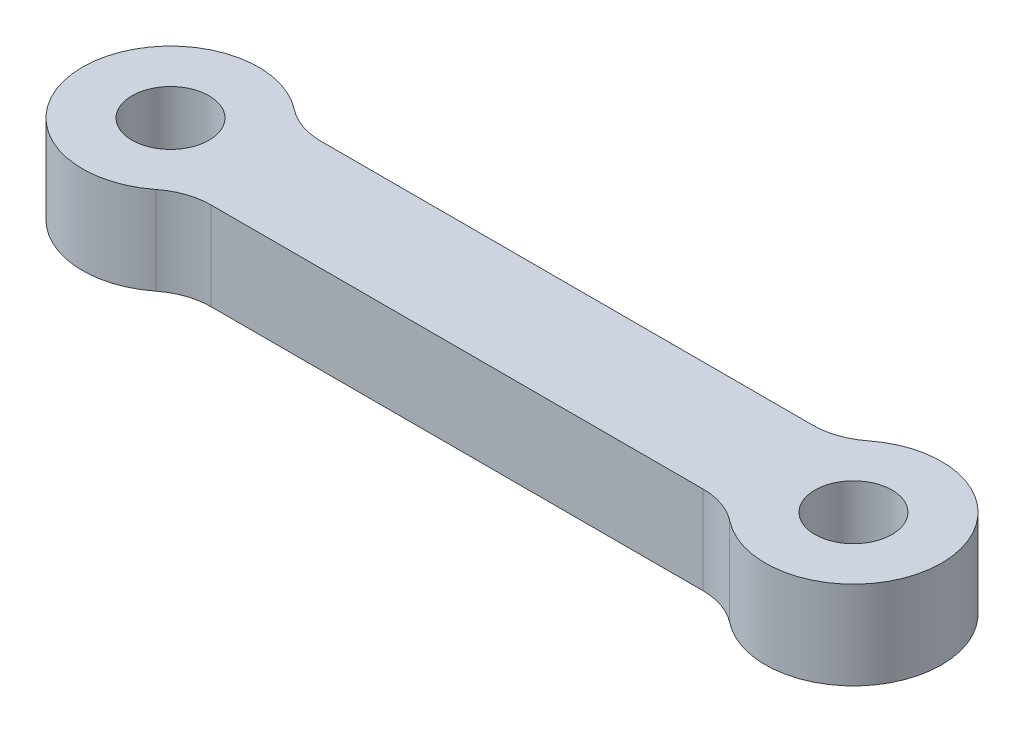
ISO-10303-21;
HEADER;
FILE_DESCRIPTION(('STEP AP214'),'2;1');
FILE_NAME('part.step','',(''),(''),'','','');
FILE_SCHEMA(('AUTOMOTIVE_DESIGN { 1 0 10303 214 1 1 1 1 }'));
ENDSEC;
DATA;
#1=APPLICATION_CONTEXT('core data for automotive mechanical design processes');
#2=APPLICATION_PROTOCOL_DEFINITION('international standard','automotive_design',2000,#1);
#3=PRODUCT_CONTEXT('',#1,'mechanical');
#4=PRODUCT('Part','Part','',(#3));
#5=PRODUCT_RELATED_PRODUCT_CATEGORY('part','',(#4));
#6=PRODUCT_DEFINITION_FORMATION('','',#4);
#7=PRODUCT_DEFINITION_CONTEXT('part definition',#1,'design');
#8=PRODUCT_DEFINITION('design','',#6,#7);
#9=PRODUCT_DEFINITION_SHAPE('','',#8);
#10=(LENGTH_UNIT() NAMED_UNIT(*) SI_UNIT(.MILLI.,.METRE.));
#11=(NAMED_UNIT(*) PLANE_ANGLE_UNIT() SI_UNIT($,.RADIAN.));
#12=(NAMED_UNIT(*) SI_UNIT($,.STERADIAN.) SOLID_ANGLE_UNIT());
#13=UNCERTAINTY_MEASURE_WITH_UNIT(LENGTH_MEASURE(1.E-05),#10,'distance_accuracy_value','');
#14=(GEOMETRIC_REPRESENTATION_CONTEXT(3) GLOBAL_UNCERTAINTY_ASSIGNED_CONTEXT((#13)) GLOBAL_UNIT_ASSIGNED_CONTEXT((#10,
#11,#12)) REPRESENTATION_CONTEXT('',''));
#15=CARTESIAN_POINT('',(0.,0.,0.));
#16=DIRECTION('',(0.,0.,1.));
#17=DIRECTION('',(1.,0.,0.));
#18=AXIS2_PLACEMENT_3D('',#15,#16,#17);
#19=CARTESIAN_POINT('',(31.,4.,0.));
#20=DIRECTION('',(0.,-1.,0.));
#21=DIRECTION('',(0.,0.,-1.));
#22=AXIS2_PLACEMENT_3D('',#19,#20,#21);
#23=CYLINDRICAL_SURFACE('',#22,4.00000000000001);
#24=CARTESIAN_POINT('',(31.,4.,0.));
#25=DIRECTION('',(0.,1.,0.));
#26=DIRECTION('',(0.,0.,1.));
#27=AXIS2_PLACEMENT_3D('',#24,#25,#26);
#28=CIRCLE('',#27,4.00000000000001);
#29=CARTESIAN_POINT('',(28.525641703473,4.,3.14285714285714));
#30=VERTEX_POINT('',#29);
#31=CARTESIAN_POINT('',(28.525641703473,4.,-3.14285714285714));
#32=VERTEX_POINT('',#31);
#33=EDGE_CURVE('E142',#30,#32,#28,.T.);
#34=ORIENTED_EDGE('',*,*,#33,.F.);
#35=DIRECTION('',(0.,-1.,0.));
#36=VECTOR('',#35,1.);
#37=CARTESIAN_POINT('',(28.525641703473,4.,3.14285714285714));
#38=LINE('',#37,#36);
#39=CARTESIAN_POINT('',(28.525641703473,0.,3.14285714285714));
#40=VERTEX_POINT('',#39);
#41=EDGE_CURVE('E150',#30,#40,#38,.T.);
#42=ORIENTED_EDGE('',*,*,#41,.T.);
#43=CARTESIAN_POINT('',(31.,0.,0.));
#44=DIRECTION('',(0.,1.,0.));
#45=DIRECTION('',(0.,0.,1.));
#46=AXIS2_PLACEMENT_3D('',#43,#44,#45);
#47=CIRCLE('',#46,4.00000000000001);
#48=CARTESIAN_POINT('',(28.525641703473,0.,-3.14285714285714));
#49=VERTEX_POINT('',#48);
#50=EDGE_CURVE('E167',#40,#49,#47,.T.);
#51=ORIENTED_EDGE('',*,*,#50,.T.);
#52=DIRECTION('',(0.,-1.,0.));
#53=VECTOR('',#52,1.);
#54=CARTESIAN_POINT('',(28.525641703473,4.,-3.14285714285714));
#55=LINE('',#54,#53);
#56=EDGE_CURVE('E148',#49,#32,#55,.F.);
#57=ORIENTED_EDGE('',*,*,#56,.T.);
#58=EDGE_LOOP('',(#34,#42,#51,#57));
#59=FACE_BOUND('',#58,.T.);
#60=ADVANCED_FACE('F36',(#59),#23,.T.);
#61=CARTESIAN_POINT('',(0.,4.,-2.5));
#62=DIRECTION('',(0.,0.,-1.));
#63=DIRECTION('',(-1.,0.,0.));
#64=AXIS2_PLACEMENT_3D('',#61,#62,#63);
#65=PLANE('',#64);
#66=DIRECTION('',(1.,0.,0.));
#67=VECTOR('',#66,1.);
#68=CARTESIAN_POINT('',(0.,4.,-2.5));
#69=LINE('',#68,#67);
#70=CARTESIAN_POINT('',(4.33012701892219,4.,-2.5));
#71=VERTEX_POINT('',#70);
#72=CARTESIAN_POINT('',(26.6698729810778,4.,-2.5));
#73=VERTEX_POINT('',#72);
#74=EDGE_CURVE('E174',#71,#73,#69,.T.);
#75=ORIENTED_EDGE('',*,*,#74,.T.);
#76=DIRECTION('',(0.,-1.,0.));
#77=VECTOR('',#76,1.);
#78=CARTESIAN_POINT('',(26.6698729810778,4.,-2.5));
#79=LINE('',#78,#77);
#80=CARTESIAN_POINT('',(26.6698729810778,0.,-2.5));
#81=VERTEX_POINT('',#80);
#82=EDGE_CURVE('E113',#73,#81,#79,.T.);
#83=ORIENTED_EDGE('',*,*,#82,.T.);
#84=DIRECTION('',(1.,0.,0.));
#85=VECTOR('',#84,1.);
#86=CARTESIAN_POINT('',(0.,0.,-2.5));
#87=LINE('',#86,#85);
#88=CARTESIAN_POINT('',(4.33012701892219,0.,-2.5));
#89=VERTEX_POINT('',#88);
#90=EDGE_CURVE('E136',#89,#81,#87,.T.);
#91=ORIENTED_EDGE('',*,*,#90,.F.);
#92=DIRECTION('',(0.,-1.,0.));
#93=VECTOR('',#92,1.);
#94=CARTESIAN_POINT('',(4.33012701892219,4.,-2.5));
#95=LINE('',#94,#93);
#96=EDGE_CURVE('E58',#89,#71,#95,.F.);
#97=ORIENTED_EDGE('',*,*,#96,.T.);
#98=EDGE_LOOP('',(#75,#83,#91,#97));
#99=FACE_BOUND('',#98,.T.);
#100=ADVANCED_FACE('F165',(#99),#65,.T.);
#101=CARTESIAN_POINT('',(0.,4.,0.));
#102=DIRECTION('',(0.,-1.,0.));
#103=DIRECTION('',(0.,0.,-1.));
#104=AXIS2_PLACEMENT_3D('',#101,#102,#103);
#105=CYLINDRICAL_SURFACE('',#104,4.);
#106=CARTESIAN_POINT('',(0.,0.,0.));
#107=DIRECTION('',(0.,1.,0.));
#108=DIRECTION('',(0.,0.,1.));
#109=AXIS2_PLACEMENT_3D('',#106,#107,#108);
#110=CIRCLE('',#109,4.);
#111=CARTESIAN_POINT('',(2.47435829652697,0.,-3.14285714285714));
#112=VERTEX_POINT('',#111);
#113=CARTESIAN_POINT('',(2.47435829652697,0.,3.14285714285714));
#114=VERTEX_POINT('',#113);
#115=EDGE_CURVE('E131',#112,#114,#110,.T.);
#116=ORIENTED_EDGE('',*,*,#115,.T.);
#117=DIRECTION('',(0.,-1.,0.));
#118=VECTOR('',#117,1.);
#119=CARTESIAN_POINT('',(2.47435829652697,4.,3.14285714285714));
#120=LINE('',#119,#118);
#121=CARTESIAN_POINT('',(2.47435829652697,4.,3.14285714285714));
#122=VERTEX_POINT('',#121);
#123=EDGE_CURVE('E107',#114,#122,#120,.F.);
#124=ORIENTED_EDGE('',*,*,#123,.T.);
#125=CARTESIAN_POINT('',(0.,4.,0.));
#126=DIRECTION('',(0.,1.,0.));
#127=DIRECTION('',(0.,0.,1.));
#128=AXIS2_PLACEMENT_3D('',#125,#126,#127);
#129=CIRCLE('',#128,4.);
#130=CARTESIAN_POINT('',(2.47435829652697,4.,-3.14285714285714));
#131=VERTEX_POINT('',#130);
#132=EDGE_CURVE('E173',#131,#122,#129,.T.);
#133=ORIENTED_EDGE('',*,*,#132,.F.);
#134=DIRECTION('',(0.,-1.,0.));
#135=VECTOR('',#134,1.);
#136=CARTESIAN_POINT('',(2.47435829652697,4.,-3.14285714285714));
#137=LINE('',#136,#135);
#138=EDGE_CURVE('E123',#131,#112,#137,.T.);
#139=ORIENTED_EDGE('',*,*,#138,.T.);
#140=EDGE_LOOP('',(#116,#124,#133,#139));
#141=FACE_BOUND('',#140,.T.);
#142=ADVANCED_FACE('F176',(#141),#105,.T.);
#143=CARTESIAN_POINT('',(0.,4.,0.));
#144=DIRECTION('',(0.,-1.,0.));
#145=DIRECTION('',(0.,0.,-1.));
#146=AXIS2_PLACEMENT_3D('',#143,#144,#145);
#147=CYLINDRICAL_SURFACE('',#146,1.75);
#148=CARTESIAN_POINT('',(0.,4.,0.));
#149=DIRECTION('',(0.,1.,0.));
#150=DIRECTION('',(0.,0.,1.));
#151=AXIS2_PLACEMENT_3D('',#148,#149,#150);
#152=CIRCLE('',#151,1.75);
#153=CARTESIAN_POINT('',(0.,4.,1.75));
#154=VERTEX_POINT('',#153);
#155=EDGE_CURVE('E178',#154,#154,#152,.T.);
#156=ORIENTED_EDGE('',*,*,#155,.T.);
#157=EDGE_LOOP('',(#156));
#158=FACE_BOUND('',#157,.T.);
#159=CARTESIAN_POINT('',(0.,0.,0.));
#160=DIRECTION('',(0.,1.,0.));
#161=DIRECTION('',(0.,0.,1.));
#162=AXIS2_PLACEMENT_3D('',#159,#160,#161);
#163=CIRCLE('',#162,1.75);
#164=CARTESIAN_POINT('',(0.,0.,1.75));
#165=VERTEX_POINT('',#164);
#166=EDGE_CURVE('E130',#165,#165,#163,.T.);
#167=ORIENTED_EDGE('',*,*,#166,.F.);
#168=EDGE_LOOP('',(#167));
#169=FACE_BOUND('',#168,.T.);
#170=ADVANCED_FACE('F224',(#158,#169),#147,.F.);
#171=CARTESIAN_POINT('',(0.,4.,2.5));
#172=DIRECTION('',(0.,0.,-1.));
#173=DIRECTION('',(-1.,0.,0.));
#174=AXIS2_PLACEMENT_3D('',#171,#172,#173);
#175=PLANE('',#174);
#176=DIRECTION('',(1.,0.,0.));
#177=VECTOR('',#176,1.);
#178=CARTESIAN_POINT('',(0.,4.,2.5));
#179=LINE('',#178,#177);
#180=CARTESIAN_POINT('',(4.3301270189222,4.,2.5));
#181=VERTEX_POINT('',#180);
#182=CARTESIAN_POINT('',(26.6698729810778,4.,2.5));
#183=VERTEX_POINT('',#182);
#184=EDGE_CURVE('E122',#181,#183,#179,.T.);
#185=ORIENTED_EDGE('',*,*,#184,.F.);
#186=DIRECTION('',(0.,1.,0.));
#187=VECTOR('',#186,1.);
#188=CARTESIAN_POINT('',(4.3301270189222,0.,2.5));
#189=LINE('',#188,#187);
#190=CARTESIAN_POINT('',(4.3301270189222,0.,2.5));
#191=VERTEX_POINT('',#190);
#192=EDGE_CURVE('E106',#181,#191,#189,.F.);
#193=ORIENTED_EDGE('',*,*,#192,.T.);
#194=DIRECTION('',(1.,0.,0.));
#195=VECTOR('',#194,1.);
#196=CARTESIAN_POINT('',(0.,0.,2.5));
#197=LINE('',#196,#195);
#198=CARTESIAN_POINT('',(26.6698729810778,0.,2.5));
#199=VERTEX_POINT('',#198);
#200=EDGE_CURVE('E119',#191,#199,#197,.T.);
#201=ORIENTED_EDGE('',*,*,#200,.T.);
#202=DIRECTION('',(0.,1.,0.));
#203=VECTOR('',#202,1.);
#204=CARTESIAN_POINT('',(26.6698729810778,4.,2.5));
#205=LINE('',#204,#203);
#206=EDGE_CURVE('E124',#199,#183,#205,.T.);
#207=ORIENTED_EDGE('',*,*,#206,.T.);
#208=EDGE_LOOP('',(#185,#193,#201,#207));
#209=FACE_BOUND('',#208,.T.);
#210=ADVANCED_FACE('F118',(#209),#175,.F.);
#211=CARTESIAN_POINT('',(31.,4.,0.));
#212=DIRECTION('',(0.,-1.,0.));
#213=DIRECTION('',(0.,0.,-1.));
#214=AXIS2_PLACEMENT_3D('',#211,#212,#213);
#215=CYLINDRICAL_SURFACE('',#214,1.75);
#216=CARTESIAN_POINT('',(31.,4.,0.));
#217=DIRECTION('',(0.,1.,0.));
#218=DIRECTION('',(0.,0.,1.));
#219=AXIS2_PLACEMENT_3D('',#216,#217,#218);
#220=CIRCLE('',#219,1.75);
#221=CARTESIAN_POINT('',(31.,4.,1.75));
#222=VERTEX_POINT('',#221);
#223=EDGE_CURVE('E143',#222,#222,#220,.T.);
#224=ORIENTED_EDGE('',*,*,#223,.T.);
#225=EDGE_LOOP('',(#224));
#226=FACE_BOUND('',#225,.T.);
#227=CARTESIAN_POINT('',(31.,0.,0.));
#228=DIRECTION('',(0.,1.,0.));
#229=DIRECTION('',(0.,0.,1.));
#230=AXIS2_PLACEMENT_3D('',#227,#228,#229);
#231=CIRCLE('',#230,1.75);
#232=CARTESIAN_POINT('',(31.,0.,1.75));
#233=VERTEX_POINT('',#232);
#234=EDGE_CURVE('E134',#233,#233,#231,.T.);
#235=ORIENTED_EDGE('',*,*,#234,.F.);
#236=EDGE_LOOP('',(#235));
#237=FACE_BOUND('',#236,.T.);
#238=ADVANCED_FACE('F218',(#226,#237),#215,.F.);
#239=CARTESIAN_POINT('',(0.,4.,0.));
#240=DIRECTION('',(0.,1.,0.));
#241=DIRECTION('',(0.,0.,1.));
#242=AXIS2_PLACEMENT_3D('',#239,#240,#241);
#243=PLANE('',#242);
#244=ORIENTED_EDGE('',*,*,#184,.T.);
#245=CARTESIAN_POINT('',(26.6698729810778,4.,5.5));
#246=DIRECTION('',(0.,1.,0.));
#247=DIRECTION('',(0.,0.,1.));
#248=AXIS2_PLACEMENT_3D('',#245,#246,#247);
#249=CIRCLE('',#248,3.);
#250=EDGE_CURVE('E158',#183,#30,#249,.F.);
#251=ORIENTED_EDGE('',*,*,#250,.T.);
#252=ORIENTED_EDGE('',*,*,#33,.T.);
#253=CARTESIAN_POINT('',(26.6698729810778,4.,-5.5));
#254=DIRECTION('',(0.,1.,0.));
#255=DIRECTION('',(0.,0.,1.));
#256=AXIS2_PLACEMENT_3D('',#253,#254,#255);
#257=CIRCLE('',#256,3.);
#258=EDGE_CURVE('E51',#32,#73,#257,.F.);
#259=ORIENTED_EDGE('',*,*,#258,.T.);
#260=ORIENTED_EDGE('',*,*,#74,.F.);
#261=CARTESIAN_POINT('',(4.33012701892219,4.,-5.5));
#262=DIRECTION('',(0.,1.,0.));
#263=DIRECTION('',(0.,0.,1.));
#264=AXIS2_PLACEMENT_3D('',#261,#262,#263);
#265=CIRCLE('',#264,3.);
#266=EDGE_CURVE('E11',#71,#131,#265,.F.);
#267=ORIENTED_EDGE('',*,*,#266,.T.);
#268=ORIENTED_EDGE('',*,*,#132,.T.);
#269=CARTESIAN_POINT('',(4.3301270189222,4.,5.5));
#270=DIRECTION('',(0.,1.,0.));
#271=DIRECTION('',(0.,0.,1.));
#272=AXIS2_PLACEMENT_3D('',#269,#270,#271);
#273=CIRCLE('',#272,3.);
#274=EDGE_CURVE('E112',#122,#181,#273,.F.);
#275=ORIENTED_EDGE('',*,*,#274,.T.);
#276=EDGE_LOOP('',(#244,#251,#252,#259,#260,#267,#268,#275));
#277=FACE_BOUND('',#276,.T.);
#278=ORIENTED_EDGE('',*,*,#155,.F.);
#279=EDGE_LOOP('',(#278));
#280=FACE_BOUND('',#279,.T.);
#281=ORIENTED_EDGE('',*,*,#223,.F.);
#282=EDGE_LOOP('',(#281));
#283=FACE_BOUND('',#282,.T.);
#284=ADVANCED_FACE('F171',(#277,#280,#283),#243,.T.);
#285=CARTESIAN_POINT('',(0.,0.,0.));
#286=DIRECTION('',(0.,1.,0.));
#287=DIRECTION('',(0.,0.,1.));
#288=AXIS2_PLACEMENT_3D('',#285,#286,#287);
#289=PLANE('',#288);
#290=ORIENTED_EDGE('',*,*,#50,.F.);
#291=CARTESIAN_POINT('',(26.6698729810778,0.,5.5));
#292=DIRECTION('',(0.,1.,0.));
#293=DIRECTION('',(0.,0.,1.));
#294=AXIS2_PLACEMENT_3D('',#291,#292,#293);
#295=CIRCLE('',#294,3.);
#296=EDGE_CURVE('E129',#40,#199,#295,.T.);
#297=ORIENTED_EDGE('',*,*,#296,.T.);
#298=ORIENTED_EDGE('',*,*,#200,.F.);
#299=CARTESIAN_POINT('',(4.3301270189222,0.,5.5));
#300=DIRECTION('',(0.,1.,0.));
#301=DIRECTION('',(0.,0.,1.));
#302=AXIS2_PLACEMENT_3D('',#299,#300,#301);
#303=CIRCLE('',#302,3.);
#304=EDGE_CURVE('E102',#191,#114,#303,.T.);
#305=ORIENTED_EDGE('',*,*,#304,.T.);
#306=ORIENTED_EDGE('',*,*,#115,.F.);
#307=CARTESIAN_POINT('',(4.33012701892219,0.,-5.5));
#308=DIRECTION('',(0.,1.,0.));
#309=DIRECTION('',(0.,0.,1.));
#310=AXIS2_PLACEMENT_3D('',#307,#308,#309);
#311=CIRCLE('',#310,3.);
#312=EDGE_CURVE('E44',#112,#89,#311,.T.);
#313=ORIENTED_EDGE('',*,*,#312,.T.);
#314=ORIENTED_EDGE('',*,*,#90,.T.);
#315=CARTESIAN_POINT('',(26.6698729810778,0.,-5.5));
#316=DIRECTION('',(0.,1.,0.));
#317=DIRECTION('',(0.,0.,1.));
#318=AXIS2_PLACEMENT_3D('',#315,#316,#317);
#319=CIRCLE('',#318,3.);
#320=EDGE_CURVE('E160',#81,#49,#319,.T.);
#321=ORIENTED_EDGE('',*,*,#320,.T.);
#322=EDGE_LOOP('',(#290,#297,#298,#305,#306,#313,#314,#321));
#323=FACE_BOUND('',#322,.T.);
#324=ORIENTED_EDGE('',*,*,#166,.T.);
#325=EDGE_LOOP('',(#324));
#326=FACE_BOUND('',#325,.T.);
#327=ORIENTED_EDGE('',*,*,#234,.T.);
#328=EDGE_LOOP('',(#327));
#329=FACE_BOUND('',#328,.T.);
#330=ADVANCED_FACE('F127',(#323,#326,#329),#289,.F.);
#331=CARTESIAN_POINT('',(4.3301270189222,4.,5.5));
#332=DIRECTION('',(0.,-1.,0.));
#333=DIRECTION('',(0.,0.,-1.));
#334=AXIS2_PLACEMENT_3D('',#331,#332,#333);
#335=CYLINDRICAL_SURFACE('',#334,3.);
#336=ORIENTED_EDGE('',*,*,#274,.F.);
#337=ORIENTED_EDGE('',*,*,#123,.F.);
#338=ORIENTED_EDGE('',*,*,#304,.F.);
#339=ORIENTED_EDGE('',*,*,#192,.F.);
#340=EDGE_LOOP('',(#336,#337,#338,#339));
#341=FACE_BOUND('',#340,.T.);
#342=ADVANCED_FACE('F105',(#341),#335,.F.);
#343=CARTESIAN_POINT('',(26.6698729810778,4.,5.5));
#344=DIRECTION('',(0.,-1.,0.));
#345=DIRECTION('',(0.,0.,-1.));
#346=AXIS2_PLACEMENT_3D('',#343,#344,#345);
#347=CYLINDRICAL_SURFACE('',#346,3.);
#348=ORIENTED_EDGE('',*,*,#250,.F.);
#349=ORIENTED_EDGE('',*,*,#206,.F.);
#350=ORIENTED_EDGE('',*,*,#296,.F.);
#351=ORIENTED_EDGE('',*,*,#41,.F.);
#352=EDGE_LOOP('',(#348,#349,#350,#351));
#353=FACE_BOUND('',#352,.T.);
#354=ADVANCED_FACE('F195',(#353),#347,.F.);
#355=CARTESIAN_POINT('',(26.6698729810778,4.,-5.5));
#356=DIRECTION('',(0.,-1.,0.));
#357=DIRECTION('',(0.,0.,-1.));
#358=AXIS2_PLACEMENT_3D('',#355,#356,#357);
#359=CYLINDRICAL_SURFACE('',#358,3.);
#360=ORIENTED_EDGE('',*,*,#258,.F.);
#361=ORIENTED_EDGE('',*,*,#56,.F.);
#362=ORIENTED_EDGE('',*,*,#320,.F.);
#363=ORIENTED_EDGE('',*,*,#82,.F.);
#364=EDGE_LOOP('',(#360,#361,#362,#363));
#365=FACE_BOUND('',#364,.T.);
#366=ADVANCED_FACE('F193',(#365),#359,.F.);
#367=CARTESIAN_POINT('',(4.33012701892219,4.,-5.5));
#368=DIRECTION('',(0.,-1.,0.));
#369=DIRECTION('',(0.,0.,-1.));
#370=AXIS2_PLACEMENT_3D('',#367,#368,#369);
#371=CYLINDRICAL_SURFACE('',#370,3.);
#372=ORIENTED_EDGE('',*,*,#266,.F.);
#373=ORIENTED_EDGE('',*,*,#96,.F.);
#374=ORIENTED_EDGE('',*,*,#312,.F.);
#375=ORIENTED_EDGE('',*,*,#138,.F.);
#376=EDGE_LOOP('',(#372,#373,#374,#375));
#377=FACE_BOUND('',#376,.T.);
#378=ADVANCED_FACE('F38',(#377),#371,.F.);
#379=CLOSED_SHELL('',(#60,#100,#142,#170,#210,#238,#284,#330,#342,#354,#366,#378));
#380=MANIFOLD_SOLID_BREP('B2',#379);
#381=ADVANCED_BREP_SHAPE_REPRESENTATION('',(#18,#380),#14);
#382=SHAPE_DEFINITION_REPRESENTATION(#9,#381);
ENDSEC;
END-ISO-10303-21;
